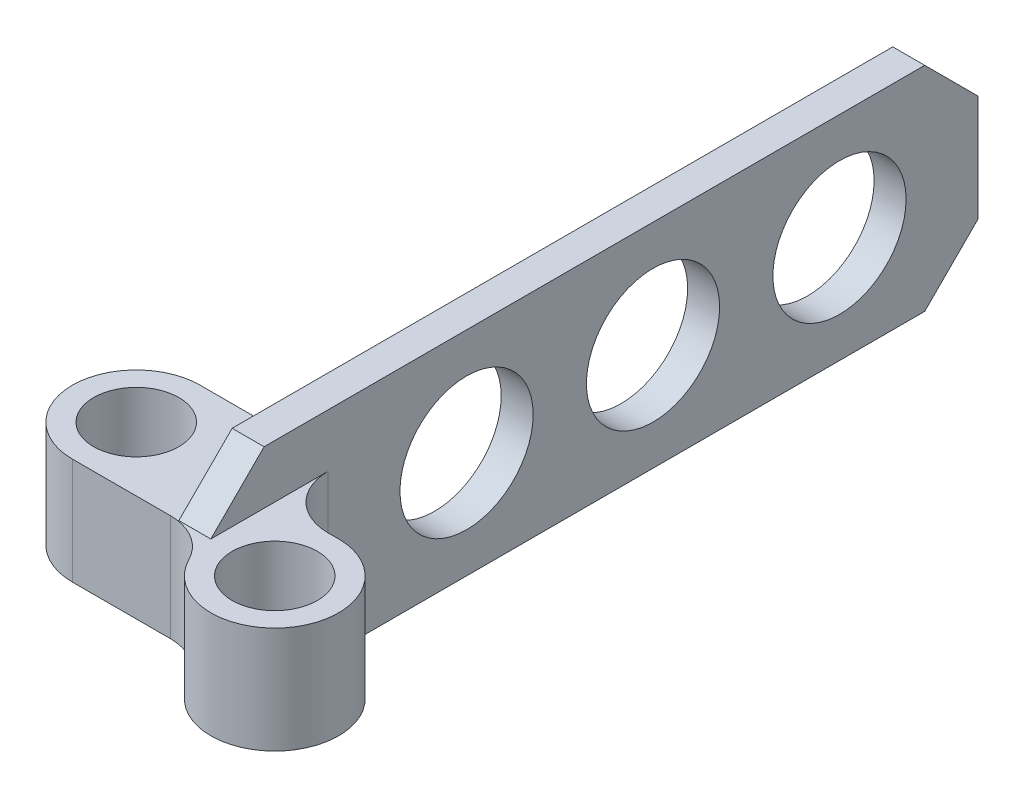
ISO-10303-21;
HEADER;
FILE_DESCRIPTION(('STEP AP214'),'2;1');
FILE_NAME('part.step','',(''),(''),'','','');
FILE_SCHEMA(('AUTOMOTIVE_DESIGN { 1 0 10303 214 1 1 1 1 }'));
ENDSEC;
DATA;
#1=APPLICATION_CONTEXT('core data for automotive mechanical design processes');
#2=APPLICATION_PROTOCOL_DEFINITION('international standard','automotive_design',2000,#1);
#3=PRODUCT_CONTEXT('',#1,'mechanical');
#4=PRODUCT('Part','Part','',(#3));
#5=PRODUCT_RELATED_PRODUCT_CATEGORY('part','',(#4));
#6=PRODUCT_DEFINITION_FORMATION('','',#4);
#7=PRODUCT_DEFINITION_CONTEXT('part definition',#1,'design');
#8=PRODUCT_DEFINITION('design','',#6,#7);
#9=PRODUCT_DEFINITION_SHAPE('','',#8);
#10=(LENGTH_UNIT() NAMED_UNIT(*) SI_UNIT(.MILLI.,.METRE.));
#11=(NAMED_UNIT(*) PLANE_ANGLE_UNIT() SI_UNIT($,.RADIAN.));
#12=(NAMED_UNIT(*) SI_UNIT($,.STERADIAN.) SOLID_ANGLE_UNIT());
#13=UNCERTAINTY_MEASURE_WITH_UNIT(LENGTH_MEASURE(1.E-05),#10,'distance_accuracy_value','');
#14=(GEOMETRIC_REPRESENTATION_CONTEXT(3) GLOBAL_UNCERTAINTY_ASSIGNED_CONTEXT((#13)) GLOBAL_UNIT_ASSIGNED_CONTEXT((#10,
#11,#12)) REPRESENTATION_CONTEXT('',''));
#15=CARTESIAN_POINT('',(0.,0.,0.));
#16=DIRECTION('',(0.,0.,1.));
#17=DIRECTION('',(1.,0.,0.));
#18=AXIS2_PLACEMENT_3D('',#15,#16,#17);
#19=CARTESIAN_POINT('',(0.,40.,0.));
#20=DIRECTION('',(-1.,0.,0.));
#21=DIRECTION('',(0.,0.,1.));
#22=AXIS2_PLACEMENT_3D('',#19,#20,#21);
#23=PLANE('',#22);
#24=CARTESIAN_POINT('',(0.,20.,-48.));
#25=DIRECTION('',(1.,0.,0.));
#26=DIRECTION('',(0.,0.,1.));
#27=AXIS2_PLACEMENT_3D('',#24,#25,#26);
#28=CIRCLE('',#27,12.5);
#29=CARTESIAN_POINT('',(0.,20.,-35.5));
#30=VERTEX_POINT('',#29);
#31=EDGE_CURVE('E415',#30,#30,#28,.T.);
#32=ORIENTED_EDGE('',*,*,#31,.F.);
#33=EDGE_LOOP('',(#32));
#34=FACE_BOUND('',#33,.T.);
#35=CARTESIAN_POINT('',(0.,20.,-118.));
#36=DIRECTION('',(1.,0.,0.));
#37=DIRECTION('',(0.,0.,-1.));
#38=AXIS2_PLACEMENT_3D('',#35,#36,#37);
#39=CIRCLE('',#38,12.5);
#40=CARTESIAN_POINT('',(0.,20.,-130.5));
#41=VERTEX_POINT('',#40);
#42=EDGE_CURVE('E419',#41,#41,#39,.T.);
#43=ORIENTED_EDGE('',*,*,#42,.F.);
#44=EDGE_LOOP('',(#43));
#45=FACE_BOUND('',#44,.T.);
#46=CARTESIAN_POINT('',(0.,20.,-83.));
#47=DIRECTION('',(1.,0.,0.));
#48=DIRECTION('',(0.,0.,-1.));
#49=AXIS2_PLACEMENT_3D('',#46,#47,#48);
#50=CIRCLE('',#49,12.5);
#51=CARTESIAN_POINT('',(0.,20.,-95.5));
#52=VERTEX_POINT('',#51);
#53=EDGE_CURVE('E308',#52,#52,#50,.T.);
#54=ORIENTED_EDGE('',*,*,#53,.F.);
#55=EDGE_LOOP('',(#54));
#56=FACE_BOUND('',#55,.T.);
#57=DIRECTION('',(0.,0.,-1.));
#58=VECTOR('',#57,1.);
#59=CARTESIAN_POINT('',(0.,30.,12.001));
#60=LINE('',#59,#58);
#61=CARTESIAN_POINT('',(0.,30.,0.));
#62=VERTEX_POINT('',#61);
#63=CARTESIAN_POINT('',(0.,30.,-22.));
#64=VERTEX_POINT('',#63);
#65=EDGE_CURVE('E195',#62,#64,#60,.T.);
#66=ORIENTED_EDGE('',*,*,#65,.T.);
#67=DIRECTION('',(0.,1.,0.));
#68=VECTOR('',#67,1.);
#69=CARTESIAN_POINT('',(0.,10.,-22.));
#70=LINE('',#69,#68);
#71=CARTESIAN_POINT('',(0.,10.,-22.));
#72=VERTEX_POINT('',#71);
#73=EDGE_CURVE('E176',#64,#72,#70,.F.);
#74=ORIENTED_EDGE('',*,*,#73,.T.);
#75=DIRECTION('',(0.,0.,-1.));
#76=VECTOR('',#75,1.);
#77=CARTESIAN_POINT('',(0.,10.,12.001));
#78=LINE('',#77,#76);
#79=CARTESIAN_POINT('',(0.,10.,0.));
#80=VERTEX_POINT('',#79);
#81=EDGE_CURVE('E183',#80,#72,#78,.T.);
#82=ORIENTED_EDGE('',*,*,#81,.F.);
#83=DIRECTION('',(0.,0.707106781186548,0.707106781186547));
#84=VECTOR('',#83,1.);
#85=CARTESIAN_POINT('',(0.,0.,-10.));
#86=LINE('',#85,#84);
#87=CARTESIAN_POINT('',(0.,0.,-10.));
#88=VERTEX_POINT('',#87);
#89=EDGE_CURVE('E296',#88,#80,#86,.T.);
#90=ORIENTED_EDGE('',*,*,#89,.F.);
#91=DIRECTION('',(0.,0.,-1.));
#92=VECTOR('',#91,1.);
#93=CARTESIAN_POINT('',(0.,0.,0.));
#94=LINE('',#93,#92);
#95=CARTESIAN_POINT('',(0.,0.,-134.));
#96=VERTEX_POINT('',#95);
#97=EDGE_CURVE('E223',#88,#96,#94,.T.);
#98=ORIENTED_EDGE('',*,*,#97,.T.);
#99=DIRECTION('',(0.,-0.707106781186546,0.707106781186549));
#100=VECTOR('',#99,1.);
#101=CARTESIAN_POINT('',(0.,10.,-144.));
#102=LINE('',#101,#100);
#103=CARTESIAN_POINT('',(0.,10.,-144.));
#104=VERTEX_POINT('',#103);
#105=EDGE_CURVE('E260',#96,#104,#102,.F.);
#106=ORIENTED_EDGE('',*,*,#105,.T.);
#107=DIRECTION('',(0.,-1.,0.));
#108=VECTOR('',#107,1.);
#109=CARTESIAN_POINT('',(0.,40.,-144.));
#110=LINE('',#109,#108);
#111=CARTESIAN_POINT('',(0.,30.,-144.));
#112=VERTEX_POINT('',#111);
#113=EDGE_CURVE('E242',#112,#104,#110,.T.);
#114=ORIENTED_EDGE('',*,*,#113,.F.);
#115=DIRECTION('',(0.,0.707106781186548,0.707106781186548));
#116=VECTOR('',#115,1.);
#117=CARTESIAN_POINT('',(0.,40.,-134.));
#118=LINE('',#117,#116);
#119=CARTESIAN_POINT('',(0.,40.,-134.));
#120=VERTEX_POINT('',#119);
#121=EDGE_CURVE('E257',#112,#120,#118,.T.);
#122=ORIENTED_EDGE('',*,*,#121,.T.);
#123=DIRECTION('',(0.,0.,-1.));
#124=VECTOR('',#123,1.);
#125=CARTESIAN_POINT('',(0.,40.,0.));
#126=LINE('',#125,#124);
#127=CARTESIAN_POINT('',(0.,40.,-10.));
#128=VERTEX_POINT('',#127);
#129=EDGE_CURVE('E224',#128,#120,#126,.T.);
#130=ORIENTED_EDGE('',*,*,#129,.F.);
#131=DIRECTION('',(0.,0.707106781186547,-0.707106781186548));
#132=VECTOR('',#131,1.);
#133=CARTESIAN_POINT('',(0.,30.,0.));
#134=LINE('',#133,#132);
#135=EDGE_CURVE('E318',#62,#128,#134,.T.);
#136=ORIENTED_EDGE('',*,*,#135,.F.);
#137=EDGE_LOOP('',(#66,#74,#82,#90,#98,#106,#114,#122,#130,#136));
#138=FACE_BOUND('',#137,.T.);
#139=ADVANCED_FACE('F46',(#34,#45,#56,#138),#23,.F.);
#140=CARTESIAN_POINT('',(-26.,40.,-12.));
#141=DIRECTION('',(0.,1.,0.));
#142=DIRECTION('',(0.,0.,1.));
#143=AXIS2_PLACEMENT_3D('',#140,#141,#142);
#144=PLANE('',#143);
#145=DIRECTION('',(-1.,0.,0.));
#146=VECTOR('',#145,1.);
#147=CARTESIAN_POINT('',(24.001,40.,-10.));
#148=LINE('',#147,#146);
#149=CARTESIAN_POINT('',(-6.,40.,-10.));
#150=VERTEX_POINT('',#149);
#151=EDGE_CURVE('E184',#128,#150,#148,.T.);
#152=ORIENTED_EDGE('',*,*,#151,.F.);
#153=ORIENTED_EDGE('',*,*,#129,.T.);
#154=DIRECTION('',(-1.,0.,0.));
#155=VECTOR('',#154,1.);
#156=CARTESIAN_POINT('',(-6.,40.,-134.));
#157=LINE('',#156,#155);
#158=CARTESIAN_POINT('',(-6.,40.,-134.));
#159=VERTEX_POINT('',#158);
#160=EDGE_CURVE('E262',#120,#159,#157,.T.);
#161=ORIENTED_EDGE('',*,*,#160,.T.);
#162=DIRECTION('',(0.,0.,1.));
#163=VECTOR('',#162,1.);
#164=CARTESIAN_POINT('',(-6.,40.,-24.));
#165=LINE('',#164,#163);
#166=EDGE_CURVE('E226',#159,#150,#165,.T.);
#167=ORIENTED_EDGE('',*,*,#166,.T.);
#168=EDGE_LOOP('',(#152,#153,#161,#167));
#169=FACE_BOUND('',#168,.T.);
#170=ADVANCED_FACE('F354',(#169),#144,.T.);
#171=CARTESIAN_POINT('',(-26.,0.,-12.));
#172=DIRECTION('',(0.,1.,0.));
#173=DIRECTION('',(0.,0.,1.));
#174=AXIS2_PLACEMENT_3D('',#171,#172,#173);
#175=PLANE('',#174);
#176=ORIENTED_EDGE('',*,*,#97,.F.);
#177=DIRECTION('',(-1.,0.,0.));
#178=VECTOR('',#177,1.);
#179=CARTESIAN_POINT('',(24.001,0.,-10.));
#180=LINE('',#179,#178);
#181=CARTESIAN_POINT('',(-6.,0.,-10.));
#182=VERTEX_POINT('',#181);
#183=EDGE_CURVE('E315',#88,#182,#180,.T.);
#184=ORIENTED_EDGE('',*,*,#183,.T.);
#185=DIRECTION('',(0.,0.,1.));
#186=VECTOR('',#185,1.);
#187=CARTESIAN_POINT('',(-6.,0.,-24.));
#188=LINE('',#187,#186);
#189=CARTESIAN_POINT('',(-6.,0.,-134.));
#190=VERTEX_POINT('',#189);
#191=EDGE_CURVE('E227',#190,#182,#188,.T.);
#192=ORIENTED_EDGE('',*,*,#191,.F.);
#193=DIRECTION('',(1.,0.,0.));
#194=VECTOR('',#193,1.);
#195=CARTESIAN_POINT('',(-26.,0.,-134.));
#196=LINE('',#195,#194);
#197=EDGE_CURVE('E254',#190,#96,#196,.T.);
#198=ORIENTED_EDGE('',*,*,#197,.T.);
#199=EDGE_LOOP('',(#176,#184,#192,#198));
#200=FACE_BOUND('',#199,.T.);
#201=ADVANCED_FACE('F346',(#200),#175,.F.);
#202=CARTESIAN_POINT('',(0.,40.,0.));
#203=DIRECTION('',(0.,0.,-1.));
#204=DIRECTION('',(-1.,0.,0.));
#205=AXIS2_PLACEMENT_3D('',#202,#203,#204);
#206=PLANE('',#205);
#207=DIRECTION('',(-1.,0.,0.));
#208=VECTOR('',#207,1.);
#209=CARTESIAN_POINT('',(-6.,10.,0.));
#210=LINE('',#209,#208);
#211=CARTESIAN_POINT('',(-7.59591794226543,10.,0.));
#212=VERTEX_POINT('',#211);
#213=CARTESIAN_POINT('',(-26.,10.,0.));
#214=VERTEX_POINT('',#213);
#215=EDGE_CURVE('E208',#212,#214,#210,.T.);
#216=ORIENTED_EDGE('',*,*,#215,.F.);
#217=DIRECTION('',(0.,1.,0.));
#218=VECTOR('',#217,1.);
#219=CARTESIAN_POINT('',(-7.59591794226543,40.,0.));
#220=LINE('',#219,#218);
#221=CARTESIAN_POINT('',(-7.59591591657182,30.,0.));
#222=VERTEX_POINT('',#221);
#223=EDGE_CURVE('E63',#212,#222,#220,.T.);
#224=ORIENTED_EDGE('',*,*,#223,.T.);
#225=DIRECTION('',(1.,0.,0.));
#226=VECTOR('',#225,1.);
#227=CARTESIAN_POINT('',(-6.,30.,0.));
#228=LINE('',#227,#226);
#229=CARTESIAN_POINT('',(-26.,30.,0.));
#230=VERTEX_POINT('',#229);
#231=EDGE_CURVE('E219',#230,#222,#228,.T.);
#232=ORIENTED_EDGE('',*,*,#231,.F.);
#233=DIRECTION('',(0.,-1.,0.));
#234=VECTOR('',#233,1.);
#235=CARTESIAN_POINT('',(-26.,40.,0.));
#236=LINE('',#235,#234);
#237=EDGE_CURVE('E230',#230,#214,#236,.T.);
#238=ORIENTED_EDGE('',*,*,#237,.T.);
#239=EDGE_LOOP('',(#216,#224,#232,#238));
#240=FACE_BOUND('',#239,.T.);
#241=ADVANCED_FACE('F343',(#240),#206,.F.);
#242=CARTESIAN_POINT('',(0.,40.,-144.));
#243=DIRECTION('',(0.,0.,1.));
#244=DIRECTION('',(1.,0.,0.));
#245=AXIS2_PLACEMENT_3D('',#242,#243,#244);
#246=PLANE('',#245);
#247=ORIENTED_EDGE('',*,*,#113,.T.);
#248=DIRECTION('',(-1.,0.,0.));
#249=VECTOR('',#248,1.);
#250=CARTESIAN_POINT('',(0.,10.,-144.));
#251=LINE('',#250,#249);
#252=CARTESIAN_POINT('',(-6.,10.,-144.));
#253=VERTEX_POINT('',#252);
#254=EDGE_CURVE('E247',#104,#253,#251,.T.);
#255=ORIENTED_EDGE('',*,*,#254,.T.);
#256=DIRECTION('',(0.,-1.,0.));
#257=VECTOR('',#256,1.);
#258=CARTESIAN_POINT('',(-6.,40.,-144.));
#259=LINE('',#258,#257);
#260=CARTESIAN_POINT('',(-6.,30.,-144.));
#261=VERTEX_POINT('',#260);
#262=EDGE_CURVE('E239',#261,#253,#259,.T.);
#263=ORIENTED_EDGE('',*,*,#262,.F.);
#264=DIRECTION('',(1.,0.,0.));
#265=VECTOR('',#264,1.);
#266=CARTESIAN_POINT('',(0.,30.,-144.));
#267=LINE('',#266,#265);
#268=EDGE_CURVE('E245',#261,#112,#267,.T.);
#269=ORIENTED_EDGE('',*,*,#268,.T.);
#270=EDGE_LOOP('',(#247,#255,#263,#269));
#271=FACE_BOUND('',#270,.T.);
#272=ADVANCED_FACE('F345',(#271),#246,.F.);
#273=CARTESIAN_POINT('',(-6.,40.,-24.));
#274=DIRECTION('',(1.,0.,0.));
#275=DIRECTION('',(0.,0.,-1.));
#276=AXIS2_PLACEMENT_3D('',#273,#274,#275);
#277=PLANE('',#276);
#278=CARTESIAN_POINT('',(-6.,20.,-48.));
#279=DIRECTION('',(1.,0.,0.));
#280=DIRECTION('',(0.,0.,-1.));
#281=AXIS2_PLACEMENT_3D('',#278,#279,#280);
#282=CIRCLE('',#281,12.5);
#283=CARTESIAN_POINT('',(-6.,20.,-60.5));
#284=VERTEX_POINT('',#283);
#285=EDGE_CURVE('E418',#284,#284,#282,.F.);
#286=ORIENTED_EDGE('',*,*,#285,.F.);
#287=EDGE_LOOP('',(#286));
#288=FACE_BOUND('',#287,.T.);
#289=CARTESIAN_POINT('',(-6.,20.,-118.));
#290=DIRECTION('',(1.,0.,0.));
#291=DIRECTION('',(0.,0.,-1.));
#292=AXIS2_PLACEMENT_3D('',#289,#290,#291);
#293=CIRCLE('',#292,12.5);
#294=CARTESIAN_POINT('',(-6.,20.,-130.5));
#295=VERTEX_POINT('',#294);
#296=EDGE_CURVE('E422',#295,#295,#293,.F.);
#297=ORIENTED_EDGE('',*,*,#296,.F.);
#298=EDGE_LOOP('',(#297));
#299=FACE_BOUND('',#298,.T.);
#300=CARTESIAN_POINT('',(-6.,20.,-83.));
#301=DIRECTION('',(1.,0.,0.));
#302=DIRECTION('',(0.,0.,-1.));
#303=AXIS2_PLACEMENT_3D('',#300,#301,#302);
#304=CIRCLE('',#303,12.5);
#305=CARTESIAN_POINT('',(-6.,20.,-95.5));
#306=VERTEX_POINT('',#305);
#307=EDGE_CURVE('E304',#306,#306,#304,.F.);
#308=ORIENTED_EDGE('',*,*,#307,.F.);
#309=EDGE_LOOP('',(#308));
#310=FACE_BOUND('',#309,.T.);
#311=ORIENTED_EDGE('',*,*,#191,.T.);
#312=DIRECTION('',(0.,-0.707106781186548,-0.707106781186548));
#313=VECTOR('',#312,1.);
#314=CARTESIAN_POINT('',(-6.,0.,-10.));
#315=LINE('',#314,#313);
#316=CARTESIAN_POINT('',(-6.,10.,0.));
#317=VERTEX_POINT('',#316);
#318=EDGE_CURVE('E313',#317,#182,#315,.T.);
#319=ORIENTED_EDGE('',*,*,#318,.F.);
#320=DIRECTION('',(0.,0.,-1.));
#321=VECTOR('',#320,1.);
#322=CARTESIAN_POINT('',(-6.,10.,12.001));
#323=LINE('',#322,#321);
#324=CARTESIAN_POINT('',(-6.,10.,-34.));
#325=VERTEX_POINT('',#324);
#326=EDGE_CURVE('E206',#317,#325,#323,.T.);
#327=ORIENTED_EDGE('',*,*,#326,.T.);
#328=DIRECTION('',(0.,-1.,0.));
#329=VECTOR('',#328,1.);
#330=CARTESIAN_POINT('',(-6.,30.,-34.));
#331=LINE('',#330,#329);
#332=CARTESIAN_POINT('',(-6.,30.,-34.));
#333=VERTEX_POINT('',#332);
#334=EDGE_CURVE('E268',#325,#333,#331,.F.);
#335=ORIENTED_EDGE('',*,*,#334,.T.);
#336=DIRECTION('',(0.,0.,-1.));
#337=VECTOR('',#336,1.);
#338=CARTESIAN_POINT('',(-6.,30.,12.001));
#339=LINE('',#338,#337);
#340=CARTESIAN_POINT('',(-6.,30.,0.));
#341=VERTEX_POINT('',#340);
#342=EDGE_CURVE('E217',#341,#333,#339,.T.);
#343=ORIENTED_EDGE('',*,*,#342,.F.);
#344=DIRECTION('',(0.,-0.707106781186547,0.707106781186548));
#345=VECTOR('',#344,1.);
#346=CARTESIAN_POINT('',(-6.,30.,0.));
#347=LINE('',#346,#345);
#348=EDGE_CURVE('E188',#150,#341,#347,.T.);
#349=ORIENTED_EDGE('',*,*,#348,.F.);
#350=ORIENTED_EDGE('',*,*,#166,.F.);
#351=DIRECTION('',(0.,-0.707106781186548,-0.707106781186548));
#352=VECTOR('',#351,1.);
#353=CARTESIAN_POINT('',(-6.,40.,-134.));
#354=LINE('',#353,#352);
#355=EDGE_CURVE('E250',#159,#261,#354,.T.);
#356=ORIENTED_EDGE('',*,*,#355,.T.);
#357=ORIENTED_EDGE('',*,*,#262,.T.);
#358=DIRECTION('',(0.,0.707106781186546,-0.707106781186549));
#359=VECTOR('',#358,1.);
#360=CARTESIAN_POINT('',(-6.,10.,-144.));
#361=LINE('',#360,#359);
#362=EDGE_CURVE('E252',#253,#190,#361,.F.);
#363=ORIENTED_EDGE('',*,*,#362,.T.);
#364=EDGE_LOOP('',(#311,#319,#327,#335,#343,#349,#350,#356,#357,#363));
#365=FACE_BOUND('',#364,.T.);
#366=ADVANCED_FACE('F326',(#288,#299,#310,#365),#277,.F.);
#367=CARTESIAN_POINT('',(-6.,40.,-24.));
#368=DIRECTION('',(0.,0.,1.));
#369=DIRECTION('',(1.,0.,0.));
#370=AXIS2_PLACEMENT_3D('',#367,#368,#369);
#371=PLANE('',#370);
#372=DIRECTION('',(-1.,0.,0.));
#373=VECTOR('',#372,1.);
#374=CARTESIAN_POINT('',(-6.,30.,-24.));
#375=LINE('',#374,#373);
#376=CARTESIAN_POINT('',(-16.,30.,-24.));
#377=VERTEX_POINT('',#376);
#378=CARTESIAN_POINT('',(-26.,30.,-24.));
#379=VERTEX_POINT('',#378);
#380=EDGE_CURVE('E215',#377,#379,#375,.T.);
#381=ORIENTED_EDGE('',*,*,#380,.F.);
#382=DIRECTION('',(0.,-1.,0.));
#383=VECTOR('',#382,1.);
#384=CARTESIAN_POINT('',(-16.,10.,-24.));
#385=LINE('',#384,#383);
#386=CARTESIAN_POINT('',(-16.,10.,-24.));
#387=VERTEX_POINT('',#386);
#388=EDGE_CURVE('E265',#377,#387,#385,.T.);
#389=ORIENTED_EDGE('',*,*,#388,.T.);
#390=DIRECTION('',(1.,0.,0.));
#391=VECTOR('',#390,1.);
#392=CARTESIAN_POINT('',(-6.,10.,-24.));
#393=LINE('',#392,#391);
#394=CARTESIAN_POINT('',(-26.,10.,-24.));
#395=VERTEX_POINT('',#394);
#396=EDGE_CURVE('E203',#395,#387,#393,.T.);
#397=ORIENTED_EDGE('',*,*,#396,.F.);
#398=DIRECTION('',(0.,-1.,0.));
#399=VECTOR('',#398,1.);
#400=CARTESIAN_POINT('',(-26.,40.,-24.));
#401=LINE('',#400,#399);
#402=EDGE_CURVE('E236',#379,#395,#401,.T.);
#403=ORIENTED_EDGE('',*,*,#402,.F.);
#404=EDGE_LOOP('',(#381,#389,#397,#403));
#405=FACE_BOUND('',#404,.T.);
#406=ADVANCED_FACE('F335',(#405),#371,.F.);
#407=CARTESIAN_POINT('',(-26.,40.,-12.));
#408=DIRECTION('',(0.,-1.,0.));
#409=DIRECTION('',(0.,0.,-1.));
#410=AXIS2_PLACEMENT_3D('',#407,#408,#409);
#411=CYLINDRICAL_SURFACE('',#410,12.);
#412=ORIENTED_EDGE('',*,*,#402,.T.);
#413=CARTESIAN_POINT('',(-26.,10.,-12.));
#414=DIRECTION('',(0.,1.,0.));
#415=DIRECTION('',(0.,0.,1.));
#416=AXIS2_PLACEMENT_3D('',#413,#414,#415);
#417=CIRCLE('',#416,12.);
#418=EDGE_CURVE('E199',#214,#395,#417,.F.);
#419=ORIENTED_EDGE('',*,*,#418,.F.);
#420=ORIENTED_EDGE('',*,*,#237,.F.);
#421=CARTESIAN_POINT('',(-26.,30.,-12.));
#422=DIRECTION('',(0.,-1.,0.));
#423=DIRECTION('',(0.,0.,-1.));
#424=AXIS2_PLACEMENT_3D('',#421,#422,#423);
#425=CIRCLE('',#424,12.);
#426=EDGE_CURVE('E212',#379,#230,#425,.F.);
#427=ORIENTED_EDGE('',*,*,#426,.F.);
#428=EDGE_LOOP('',(#412,#419,#420,#427));
#429=FACE_BOUND('',#428,.T.);
#430=ADVANCED_FACE('F341',(#429),#411,.T.);
#431=CARTESIAN_POINT('',(-26.,40.,-12.));
#432=DIRECTION('',(0.,-1.,0.));
#433=DIRECTION('',(0.,0.,-1.));
#434=AXIS2_PLACEMENT_3D('',#431,#432,#433);
#435=CYLINDRICAL_SURFACE('',#434,8.);
#436=CARTESIAN_POINT('',(-26.,10.,-12.));
#437=DIRECTION('',(0.,1.,0.));
#438=DIRECTION('',(0.,0.,1.));
#439=AXIS2_PLACEMENT_3D('',#436,#437,#438);
#440=CIRCLE('',#439,8.);
#441=CARTESIAN_POINT('',(-26.,10.,-3.99999999999999));
#442=VERTEX_POINT('',#441);
#443=EDGE_CURVE('E202',#442,#442,#440,.F.);
#444=ORIENTED_EDGE('',*,*,#443,.T.);
#445=EDGE_LOOP('',(#444));
#446=FACE_BOUND('',#445,.T.);
#447=CARTESIAN_POINT('',(-26.,30.,-12.));
#448=DIRECTION('',(0.,-1.,0.));
#449=DIRECTION('',(0.,0.,-1.));
#450=AXIS2_PLACEMENT_3D('',#447,#448,#449);
#451=CIRCLE('',#450,8.);
#452=CARTESIAN_POINT('',(-26.,30.,-20.));
#453=VERTEX_POINT('',#452);
#454=EDGE_CURVE('E214',#453,#453,#451,.F.);
#455=ORIENTED_EDGE('',*,*,#454,.T.);
#456=EDGE_LOOP('',(#455));
#457=FACE_BOUND('',#456,.T.);
#458=ADVANCED_FACE('F375',(#446,#457),#435,.F.);
#459=CARTESIAN_POINT('',(0.,10.,-144.));
#460=DIRECTION('',(0.,0.707106781186549,0.707106781186546));
#461=DIRECTION('',(-1.,0.,0.));
#462=AXIS2_PLACEMENT_3D('',#459,#460,#461);
#463=PLANE('',#462);
#464=ORIENTED_EDGE('',*,*,#105,.F.);
#465=ORIENTED_EDGE('',*,*,#197,.F.);
#466=ORIENTED_EDGE('',*,*,#362,.F.);
#467=ORIENTED_EDGE('',*,*,#254,.F.);
#468=EDGE_LOOP('',(#464,#465,#466,#467));
#469=FACE_BOUND('',#468,.T.);
#470=ADVANCED_FACE('F379',(#469),#463,.F.);
#471=CARTESIAN_POINT('',(-26.,40.,-134.));
#472=DIRECTION('',(0.,0.707106781186547,-0.707106781186547));
#473=DIRECTION('',(1.,0.,0.));
#474=AXIS2_PLACEMENT_3D('',#471,#472,#473);
#475=PLANE('',#474);
#476=ORIENTED_EDGE('',*,*,#121,.F.);
#477=ORIENTED_EDGE('',*,*,#268,.F.);
#478=ORIENTED_EDGE('',*,*,#355,.F.);
#479=ORIENTED_EDGE('',*,*,#160,.F.);
#480=EDGE_LOOP('',(#476,#477,#478,#479));
#481=FACE_BOUND('',#480,.T.);
#482=ADVANCED_FACE('F384',(#481),#475,.T.);
#483=CARTESIAN_POINT('',(12.,0.,0.));
#484=DIRECTION('',(0.,1.,0.));
#485=DIRECTION('',(0.,0.,1.));
#486=AXIS2_PLACEMENT_3D('',#483,#484,#485);
#487=CYLINDRICAL_SURFACE('',#486,8.);
#488=CARTESIAN_POINT('',(12.,10.,0.));
#489=DIRECTION('',(0.,1.,0.));
#490=DIRECTION('',(-1.,0.,0.));
#491=AXIS2_PLACEMENT_3D('',#488,#489,#490);
#492=CIRCLE('',#491,8.);
#493=CARTESIAN_POINT('',(4.00000000000001,10.,0.));
#494=VERTEX_POINT('',#493);
#495=EDGE_CURVE('E186',#494,#494,#492,.T.);
#496=ORIENTED_EDGE('',*,*,#495,.F.);
#497=EDGE_LOOP('',(#496));
#498=FACE_BOUND('',#497,.T.);
#499=CARTESIAN_POINT('',(12.,30.,0.));
#500=DIRECTION('',(0.,-1.,0.));
#501=DIRECTION('',(1.,0.,0.));
#502=AXIS2_PLACEMENT_3D('',#499,#500,#501);
#503=CIRCLE('',#502,8.);
#504=CARTESIAN_POINT('',(20.,30.,0.));
#505=VERTEX_POINT('',#504);
#506=EDGE_CURVE('E196',#505,#505,#503,.T.);
#507=ORIENTED_EDGE('',*,*,#506,.F.);
#508=EDGE_LOOP('',(#507));
#509=FACE_BOUND('',#508,.T.);
#510=ADVANCED_FACE('F381',(#498,#509),#487,.F.);
#511=CARTESIAN_POINT('',(12.,0.,0.));
#512=DIRECTION('',(0.,1.,0.));
#513=DIRECTION('',(0.,0.,1.));
#514=AXIS2_PLACEMENT_3D('',#511,#512,#513);
#515=CYLINDRICAL_SURFACE('',#514,12.);
#516=CARTESIAN_POINT('',(12.,30.,0.));
#517=DIRECTION('',(0.,-1.,0.));
#518=DIRECTION('',(1.,0.,0.));
#519=AXIS2_PLACEMENT_3D('',#516,#517,#518);
#520=CIRCLE('',#519,12.);
#521=CARTESIAN_POINT('',(12.,30.,-12.));
#522=VERTEX_POINT('',#521);
#523=CARTESIAN_POINT('',(1.31131748603704,30.,5.45454545454546));
#524=VERTEX_POINT('',#523);
#525=EDGE_CURVE('E175',#522,#524,#520,.T.);
#526=ORIENTED_EDGE('',*,*,#525,.T.);
#527=DIRECTION('',(0.,1.,0.));
#528=VECTOR('',#527,1.);
#529=CARTESIAN_POINT('',(1.31131748603704,0.,5.45454545454546));
#530=LINE('',#529,#528);
#531=CARTESIAN_POINT('',(1.31131748603704,10.,5.45454545454546));
#532=VERTEX_POINT('',#531);
#533=EDGE_CURVE('E165',#524,#532,#530,.F.);
#534=ORIENTED_EDGE('',*,*,#533,.T.);
#535=CARTESIAN_POINT('',(12.,10.,0.));
#536=DIRECTION('',(0.,1.,0.));
#537=DIRECTION('',(-1.,0.,0.));
#538=AXIS2_PLACEMENT_3D('',#535,#536,#537);
#539=CIRCLE('',#538,12.);
#540=CARTESIAN_POINT('',(12.,10.,-12.));
#541=VERTEX_POINT('',#540);
#542=EDGE_CURVE('E173',#532,#541,#539,.T.);
#543=ORIENTED_EDGE('',*,*,#542,.T.);
#544=DIRECTION('',(0.,1.,0.));
#545=VECTOR('',#544,1.);
#546=CARTESIAN_POINT('',(12.,-0.00100000000000794,-12.));
#547=LINE('',#546,#545);
#548=EDGE_CURVE('E295',#541,#522,#547,.T.);
#549=ORIENTED_EDGE('',*,*,#548,.T.);
#550=EDGE_LOOP('',(#526,#534,#543,#549));
#551=FACE_BOUND('',#550,.T.);
#552=ADVANCED_FACE('F171',(#551),#515,.T.);
#553=CARTESIAN_POINT('',(-6.,30.,12.001));
#554=DIRECTION('',(0.,-1.,0.));
#555=DIRECTION('',(0.,0.,-1.));
#556=AXIS2_PLACEMENT_3D('',#553,#554,#555);
#557=PLANE('',#556);
#558=ORIENTED_EDGE('',*,*,#454,.F.);
#559=EDGE_LOOP('',(#558));
#560=FACE_BOUND('',#559,.T.);
#561=ORIENTED_EDGE('',*,*,#231,.T.);
#562=CARTESIAN_POINT('',(-7.59591794226543,30.,10.));
#563=DIRECTION('',(0.,-1.,0.));
#564=DIRECTION('',(1.,0.,0.));
#565=AXIS2_PLACEMENT_3D('',#562,#563,#564);
#566=CIRCLE('',#565,10.);
#567=EDGE_CURVE('E158',#222,#524,#566,.T.);
#568=ORIENTED_EDGE('',*,*,#567,.T.);
#569=ORIENTED_EDGE('',*,*,#525,.F.);
#570=DIRECTION('',(1.,0.,0.));
#571=VECTOR('',#570,1.);
#572=CARTESIAN_POINT('',(12.,30.,-12.));
#573=LINE('',#572,#571);
#574=CARTESIAN_POINT('',(10.,30.,-12.));
#575=VERTEX_POINT('',#574);
#576=EDGE_CURVE('E302',#575,#522,#573,.T.);
#577=ORIENTED_EDGE('',*,*,#576,.F.);
#578=CARTESIAN_POINT('',(10.,30.,-22.));
#579=DIRECTION('',(0.,-1.,0.));
#580=DIRECTION('',(1.,0.,0.));
#581=AXIS2_PLACEMENT_3D('',#578,#579,#580);
#582=CIRCLE('',#581,10.);
#583=EDGE_CURVE('E282',#575,#64,#582,.T.);
#584=ORIENTED_EDGE('',*,*,#583,.T.);
#585=ORIENTED_EDGE('',*,*,#65,.F.);
#586=DIRECTION('',(-1.,0.,0.));
#587=VECTOR('',#586,1.);
#588=CARTESIAN_POINT('',(24.001,30.,0.));
#589=LINE('',#588,#587);
#590=EDGE_CURVE('E13',#62,#341,#589,.T.);
#591=ORIENTED_EDGE('',*,*,#590,.T.);
#592=ORIENTED_EDGE('',*,*,#342,.T.);
#593=CARTESIAN_POINT('',(-16.,30.,-34.));
#594=DIRECTION('',(0.,-1.,0.));
#595=DIRECTION('',(0.,0.,-1.));
#596=AXIS2_PLACEMENT_3D('',#593,#594,#595);
#597=CIRCLE('',#596,10.);
#598=EDGE_CURVE('E274',#333,#377,#597,.T.);
#599=ORIENTED_EDGE('',*,*,#598,.T.);
#600=ORIENTED_EDGE('',*,*,#380,.T.);
#601=ORIENTED_EDGE('',*,*,#426,.T.);
#602=EDGE_LOOP('',(#561,#568,#569,#577,#584,#585,#591,#592,#599,#600,#601));
#603=FACE_BOUND('',#602,.T.);
#604=ORIENTED_EDGE('',*,*,#506,.T.);
#605=EDGE_LOOP('',(#604));
#606=FACE_BOUND('',#605,.T.);
#607=ADVANCED_FACE('F300',(#560,#603,#606),#557,.F.);
#608=CARTESIAN_POINT('',(0.,10.,12.001));
#609=DIRECTION('',(0.,1.,0.));
#610=DIRECTION('',(-1.,0.,0.));
#611=AXIS2_PLACEMENT_3D('',#608,#609,#610);
#612=PLANE('',#611);
#613=DIRECTION('',(-1.,0.,0.));
#614=VECTOR('',#613,1.);
#615=CARTESIAN_POINT('',(12.,10.,-12.));
#616=LINE('',#615,#614);
#617=CARTESIAN_POINT('',(10.,10.,-12.));
#618=VERTEX_POINT('',#617);
#619=EDGE_CURVE('E182',#541,#618,#616,.T.);
#620=ORIENTED_EDGE('',*,*,#619,.F.);
#621=ORIENTED_EDGE('',*,*,#542,.F.);
#622=CARTESIAN_POINT('',(-7.59591794226543,10.,10.));
#623=DIRECTION('',(0.,1.,0.));
#624=DIRECTION('',(0.,0.,1.));
#625=AXIS2_PLACEMENT_3D('',#622,#623,#624);
#626=CIRCLE('',#625,10.);
#627=EDGE_CURVE('E163',#532,#212,#626,.T.);
#628=ORIENTED_EDGE('',*,*,#627,.T.);
#629=ORIENTED_EDGE('',*,*,#215,.T.);
#630=ORIENTED_EDGE('',*,*,#418,.T.);
#631=ORIENTED_EDGE('',*,*,#396,.T.);
#632=CARTESIAN_POINT('',(-16.,10.,-34.));
#633=DIRECTION('',(0.,1.,0.));
#634=DIRECTION('',(0.,0.,1.));
#635=AXIS2_PLACEMENT_3D('',#632,#633,#634);
#636=CIRCLE('',#635,10.);
#637=EDGE_CURVE('E271',#387,#325,#636,.T.);
#638=ORIENTED_EDGE('',*,*,#637,.T.);
#639=ORIENTED_EDGE('',*,*,#326,.F.);
#640=DIRECTION('',(-1.,0.,0.));
#641=VECTOR('',#640,1.);
#642=CARTESIAN_POINT('',(0.,10.,0.));
#643=LINE('',#642,#641);
#644=EDGE_CURVE('E55',#80,#317,#643,.T.);
#645=ORIENTED_EDGE('',*,*,#644,.F.);
#646=ORIENTED_EDGE('',*,*,#81,.T.);
#647=CARTESIAN_POINT('',(10.,10.,-22.));
#648=DIRECTION('',(0.,1.,0.));
#649=DIRECTION('',(-1.,0.,0.));
#650=AXIS2_PLACEMENT_3D('',#647,#648,#649);
#651=CIRCLE('',#650,10.);
#652=EDGE_CURVE('E168',#72,#618,#651,.T.);
#653=ORIENTED_EDGE('',*,*,#652,.T.);
#654=EDGE_LOOP('',(#620,#621,#628,#629,#630,#631,#638,#639,#645,#646,#653));
#655=FACE_BOUND('',#654,.T.);
#656=ORIENTED_EDGE('',*,*,#495,.T.);
#657=EDGE_LOOP('',(#656));
#658=FACE_BOUND('',#657,.T.);
#659=ORIENTED_EDGE('',*,*,#443,.F.);
#660=EDGE_LOOP('',(#659));
#661=FACE_BOUND('',#660,.T.);
#662=ADVANCED_FACE('F179',(#655,#658,#661),#612,.F.);
#663=CARTESIAN_POINT('',(-16.,40.,-34.));
#664=DIRECTION('',(0.,1.,0.));
#665=DIRECTION('',(0.,0.,1.));
#666=AXIS2_PLACEMENT_3D('',#663,#664,#665);
#667=CYLINDRICAL_SURFACE('',#666,10.);
#668=ORIENTED_EDGE('',*,*,#598,.F.);
#669=ORIENTED_EDGE('',*,*,#334,.F.);
#670=ORIENTED_EDGE('',*,*,#637,.F.);
#671=ORIENTED_EDGE('',*,*,#388,.F.);
#672=EDGE_LOOP('',(#668,#669,#670,#671));
#673=FACE_BOUND('',#672,.T.);
#674=ADVANCED_FACE('F337',(#673),#667,.F.);
#675=CARTESIAN_POINT('',(24.001,30.,0.));
#676=DIRECTION('',(0.,-0.707106781186548,-0.707106781186547));
#677=DIRECTION('',(0.,0.707106781186547,-0.707106781186548));
#678=AXIS2_PLACEMENT_3D('',#675,#676,#677);
#679=PLANE('',#678);
#680=ORIENTED_EDGE('',*,*,#135,.T.);
#681=ORIENTED_EDGE('',*,*,#151,.T.);
#682=ORIENTED_EDGE('',*,*,#348,.T.);
#683=ORIENTED_EDGE('',*,*,#590,.F.);
#684=EDGE_LOOP('',(#680,#681,#682,#683));
#685=FACE_BOUND('',#684,.T.);
#686=ADVANCED_FACE('F321',(#685),#679,.F.);
#687=CARTESIAN_POINT('',(24.001,0.,-10.));
#688=DIRECTION('',(0.,0.707106781186547,-0.707106781186548));
#689=DIRECTION('',(0.,0.707106781186548,0.707106781186547));
#690=AXIS2_PLACEMENT_3D('',#687,#688,#689);
#691=PLANE('',#690);
#692=ORIENTED_EDGE('',*,*,#89,.T.);
#693=ORIENTED_EDGE('',*,*,#644,.T.);
#694=ORIENTED_EDGE('',*,*,#318,.T.);
#695=ORIENTED_EDGE('',*,*,#183,.F.);
#696=EDGE_LOOP('',(#692,#693,#694,#695));
#697=FACE_BOUND('',#696,.T.);
#698=ADVANCED_FACE('F395',(#697),#691,.F.);
#699=CARTESIAN_POINT('',(12.,-0.00100000000000794,-12.));
#700=DIRECTION('',(0.,0.,1.));
#701=DIRECTION('',(1.,0.,0.));
#702=AXIS2_PLACEMENT_3D('',#699,#700,#701);
#703=PLANE('',#702);
#704=ORIENTED_EDGE('',*,*,#619,.T.);
#705=DIRECTION('',(0.,1.,0.));
#706=VECTOR('',#705,1.);
#707=CARTESIAN_POINT('',(10.,30.,-12.));
#708=LINE('',#707,#706);
#709=EDGE_CURVE('E276',#618,#575,#708,.T.);
#710=ORIENTED_EDGE('',*,*,#709,.T.);
#711=ORIENTED_EDGE('',*,*,#576,.T.);
#712=ORIENTED_EDGE('',*,*,#548,.F.);
#713=EDGE_LOOP('',(#704,#710,#711,#712));
#714=FACE_BOUND('',#713,.T.);
#715=ADVANCED_FACE('F292',(#714),#703,.F.);
#716=CARTESIAN_POINT('',(10.,-0.00100000000000794,-22.));
#717=DIRECTION('',(0.,-1.,0.));
#718=DIRECTION('',(0.,0.,-1.));
#719=AXIS2_PLACEMENT_3D('',#716,#717,#718);
#720=CYLINDRICAL_SURFACE('',#719,10.);
#721=ORIENTED_EDGE('',*,*,#652,.F.);
#722=ORIENTED_EDGE('',*,*,#73,.F.);
#723=ORIENTED_EDGE('',*,*,#583,.F.);
#724=ORIENTED_EDGE('',*,*,#709,.F.);
#725=EDGE_LOOP('',(#721,#722,#723,#724));
#726=FACE_BOUND('',#725,.T.);
#727=ADVANCED_FACE('F298',(#726),#720,.F.);
#728=CARTESIAN_POINT('',(-7.59591794226543,0.,10.));
#729=DIRECTION('',(0.,1.,0.));
#730=DIRECTION('',(0.,0.,1.));
#731=AXIS2_PLACEMENT_3D('',#728,#729,#730);
#732=CYLINDRICAL_SURFACE('',#731,10.);
#733=ORIENTED_EDGE('',*,*,#567,.F.);
#734=ORIENTED_EDGE('',*,*,#223,.F.);
#735=ORIENTED_EDGE('',*,*,#627,.F.);
#736=ORIENTED_EDGE('',*,*,#533,.F.);
#737=EDGE_LOOP('',(#733,#734,#735,#736));
#738=FACE_BOUND('',#737,.T.);
#739=ADVANCED_FACE('F48',(#738),#732,.F.);
#740=CARTESIAN_POINT('',(-38.001,20.,-83.));
#741=DIRECTION('',(1.,0.,0.));
#742=DIRECTION('',(0.,0.,-1.));
#743=AXIS2_PLACEMENT_3D('',#740,#741,#742);
#744=CYLINDRICAL_SURFACE('',#743,12.5);
#745=ORIENTED_EDGE('',*,*,#53,.T.);
#746=EDGE_LOOP('',(#745));
#747=FACE_BOUND('',#746,.T.);
#748=ORIENTED_EDGE('',*,*,#307,.T.);
#749=EDGE_LOOP('',(#748));
#750=FACE_BOUND('',#749,.T.);
#751=ADVANCED_FACE('F400',(#747,#750),#744,.F.);
#752=CARTESIAN_POINT('',(-38.001,20.,-118.));
#753=DIRECTION('',(1.,0.,0.));
#754=DIRECTION('',(0.,0.,-1.));
#755=AXIS2_PLACEMENT_3D('',#752,#753,#754);
#756=CYLINDRICAL_SURFACE('',#755,12.5);
#757=ORIENTED_EDGE('',*,*,#42,.T.);
#758=EDGE_LOOP('',(#757));
#759=FACE_BOUND('',#758,.T.);
#760=ORIENTED_EDGE('',*,*,#296,.T.);
#761=EDGE_LOOP('',(#760));
#762=FACE_BOUND('',#761,.T.);
#763=ADVANCED_FACE('F403',(#759,#762),#756,.F.);
#764=CARTESIAN_POINT('',(-38.001,20.,-48.));
#765=DIRECTION('',(1.,0.,0.));
#766=DIRECTION('',(0.,0.,-1.));
#767=AXIS2_PLACEMENT_3D('',#764,#765,#766);
#768=CYLINDRICAL_SURFACE('',#767,12.5);
#769=ORIENTED_EDGE('',*,*,#31,.T.);
#770=EDGE_LOOP('',(#769));
#771=FACE_BOUND('',#770,.T.);
#772=ORIENTED_EDGE('',*,*,#285,.T.);
#773=EDGE_LOOP('',(#772));
#774=FACE_BOUND('',#773,.T.);
#775=ADVANCED_FACE('F407',(#771,#774),#768,.F.);
#776=CLOSED_SHELL('',(#139,#170,#201,#241,#272,#366,#406,#430,#458,#470,#482,#510,#552,#607,
#662,#674,#686,#698,#715,#727,#739,#751,#763,#775));
#777=MANIFOLD_SOLID_BREP('B2',#776);
#778=ADVANCED_BREP_SHAPE_REPRESENTATION('',(#18,#777),#14);
#779=SHAPE_DEFINITION_REPRESENTATION(#9,#778);
ENDSEC;
END-ISO-10303-21;
